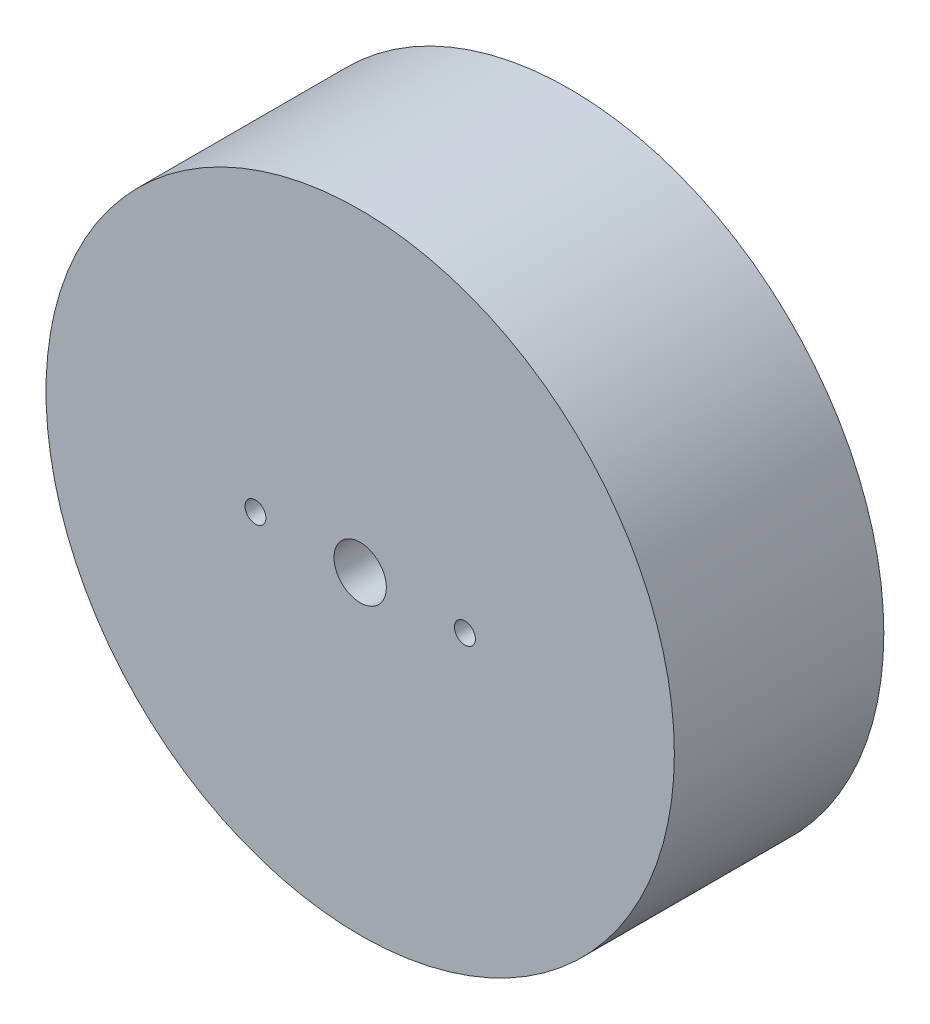
ISO-10303-21;
HEADER;
FILE_DESCRIPTION(('STEP AP214'),'2;1');
FILE_NAME('part.step','',(''),(''),'','','');
FILE_SCHEMA(('AUTOMOTIVE_DESIGN { 1 0 10303 214 1 1 1 1 }'));
ENDSEC;
DATA;
#1=APPLICATION_CONTEXT('core data for automotive mechanical design processes');
#2=APPLICATION_PROTOCOL_DEFINITION('international standard','automotive_design',2000,#1);
#3=PRODUCT_CONTEXT('',#1,'mechanical');
#4=PRODUCT('Part','Part','',(#3));
#5=PRODUCT_RELATED_PRODUCT_CATEGORY('part','',(#4));
#6=PRODUCT_DEFINITION_FORMATION('','',#4);
#7=PRODUCT_DEFINITION_CONTEXT('part definition',#1,'design');
#8=PRODUCT_DEFINITION('design','',#6,#7);
#9=PRODUCT_DEFINITION_SHAPE('','',#8);
#10=(LENGTH_UNIT() NAMED_UNIT(*) SI_UNIT(.MILLI.,.METRE.));
#11=(NAMED_UNIT(*) PLANE_ANGLE_UNIT() SI_UNIT($,.RADIAN.));
#12=(NAMED_UNIT(*) SI_UNIT($,.STERADIAN.) SOLID_ANGLE_UNIT());
#13=UNCERTAINTY_MEASURE_WITH_UNIT(LENGTH_MEASURE(1.E-05),#10,'distance_accuracy_value','');
#14=(GEOMETRIC_REPRESENTATION_CONTEXT(3) GLOBAL_UNCERTAINTY_ASSIGNED_CONTEXT((#13)) GLOBAL_UNIT_ASSIGNED_CONTEXT((#10,
#11,#12)) REPRESENTATION_CONTEXT('',''));
#15=CARTESIAN_POINT('',(0.,0.,0.));
#16=DIRECTION('',(0.,0.,1.));
#17=DIRECTION('',(1.,0.,0.));
#18=AXIS2_PLACEMENT_3D('',#15,#16,#17);
#19=CARTESIAN_POINT('',(0.,0.,20.));
#20=DIRECTION('',(0.,0.,1.));
#21=DIRECTION('',(1.,0.,0.));
#22=AXIS2_PLACEMENT_3D('',#19,#20,#21);
#23=PLANE('',#22);
#24=CARTESIAN_POINT('',(0.,0.,20.));
#25=DIRECTION('',(0.,0.,1.));
#26=DIRECTION('',(1.,0.,0.));
#27=AXIS2_PLACEMENT_3D('',#24,#25,#26);
#28=CIRCLE('',#27,2.49999999999995);
#29=CARTESIAN_POINT('',(2.49999999999995,0.,20.));
#30=VERTEX_POINT('',#29);
#31=EDGE_CURVE('E56',#30,#30,#28,.T.);
#32=ORIENTED_EDGE('',*,*,#31,.F.);
#33=EDGE_LOOP('',(#32));
#34=FACE_BOUND('',#33,.T.);
#35=CARTESIAN_POINT('',(10.,0.,20.));
#36=DIRECTION('',(0.,0.,1.));
#37=DIRECTION('',(1.,0.,0.));
#38=AXIS2_PLACEMENT_3D('',#35,#36,#37);
#39=CIRCLE('',#38,1.);
#40=CARTESIAN_POINT('',(11.,0.,20.));
#41=VERTEX_POINT('',#40);
#42=EDGE_CURVE('E42',#41,#41,#39,.T.);
#43=ORIENTED_EDGE('',*,*,#42,.F.);
#44=EDGE_LOOP('',(#43));
#45=FACE_BOUND('',#44,.T.);
#46=CARTESIAN_POINT('',(0.,0.,20.));
#47=DIRECTION('',(0.,0.,1.));
#48=DIRECTION('',(1.,0.,0.));
#49=AXIS2_PLACEMENT_3D('',#46,#47,#48);
#50=CIRCLE('',#49,30.);
#51=CARTESIAN_POINT('',(30.,0.,20.));
#52=VERTEX_POINT('',#51);
#53=EDGE_CURVE('E10',#52,#52,#50,.T.);
#54=ORIENTED_EDGE('',*,*,#53,.T.);
#55=EDGE_LOOP('',(#54));
#56=FACE_BOUND('',#55,.T.);
#57=CARTESIAN_POINT('',(-10.,0.,20.));
#58=DIRECTION('',(0.,0.,1.));
#59=DIRECTION('',(1.,0.,0.));
#60=AXIS2_PLACEMENT_3D('',#57,#58,#59);
#61=CIRCLE('',#60,1.);
#62=CARTESIAN_POINT('',(-9.,0.,20.));
#63=VERTEX_POINT('',#62);
#64=EDGE_CURVE('E47',#63,#63,#61,.T.);
#65=ORIENTED_EDGE('',*,*,#64,.F.);
#66=EDGE_LOOP('',(#65));
#67=FACE_BOUND('',#66,.T.);
#68=ADVANCED_FACE('F31',(#34,#45,#56,#67),#23,.T.);
#69=CARTESIAN_POINT('',(0.,0.,0.));
#70=DIRECTION('',(0.,0.,1.));
#71=DIRECTION('',(1.,0.,0.));
#72=AXIS2_PLACEMENT_3D('',#69,#70,#71);
#73=PLANE('',#72);
#74=CARTESIAN_POINT('',(0.,0.,0.));
#75=DIRECTION('',(0.,0.,1.));
#76=DIRECTION('',(1.,0.,0.));
#77=AXIS2_PLACEMENT_3D('',#74,#75,#76);
#78=CIRCLE('',#77,2.49999999999995);
#79=CARTESIAN_POINT('',(2.49999999999995,0.,0.));
#80=VERTEX_POINT('',#79);
#81=EDGE_CURVE('E53',#80,#80,#78,.T.);
#82=ORIENTED_EDGE('',*,*,#81,.T.);
#83=EDGE_LOOP('',(#82));
#84=FACE_BOUND('',#83,.T.);
#85=CARTESIAN_POINT('',(0.,0.,0.));
#86=DIRECTION('',(0.,0.,1.));
#87=DIRECTION('',(1.,0.,0.));
#88=AXIS2_PLACEMENT_3D('',#85,#86,#87);
#89=CIRCLE('',#88,30.);
#90=CARTESIAN_POINT('',(30.,0.,0.));
#91=VERTEX_POINT('',#90);
#92=EDGE_CURVE('E35',#91,#91,#89,.T.);
#93=ORIENTED_EDGE('',*,*,#92,.F.);
#94=EDGE_LOOP('',(#93));
#95=FACE_BOUND('',#94,.T.);
#96=CARTESIAN_POINT('',(10.,0.,0.));
#97=DIRECTION('',(0.,0.,1.));
#98=DIRECTION('',(1.,0.,0.));
#99=AXIS2_PLACEMENT_3D('',#96,#97,#98);
#100=CIRCLE('',#99,1.);
#101=CARTESIAN_POINT('',(11.,0.,0.));
#102=VERTEX_POINT('',#101);
#103=EDGE_CURVE('E44',#102,#102,#100,.T.);
#104=ORIENTED_EDGE('',*,*,#103,.T.);
#105=EDGE_LOOP('',(#104));
#106=FACE_BOUND('',#105,.T.);
#107=CARTESIAN_POINT('',(-10.,0.,0.));
#108=DIRECTION('',(0.,0.,1.));
#109=DIRECTION('',(1.,0.,0.));
#110=AXIS2_PLACEMENT_3D('',#107,#108,#109);
#111=CIRCLE('',#110,1.);
#112=CARTESIAN_POINT('',(-9.,0.,0.));
#113=VERTEX_POINT('',#112);
#114=EDGE_CURVE('E50',#113,#113,#111,.T.);
#115=ORIENTED_EDGE('',*,*,#114,.T.);
#116=EDGE_LOOP('',(#115));
#117=FACE_BOUND('',#116,.T.);
#118=ADVANCED_FACE('F62',(#84,#95,#106,#117),#73,.F.);
#119=CARTESIAN_POINT('',(0.,0.,20.));
#120=DIRECTION('',(0.,0.,-1.));
#121=DIRECTION('',(-1.,0.,0.));
#122=AXIS2_PLACEMENT_3D('',#119,#120,#121);
#123=CYLINDRICAL_SURFACE('',#122,30.);
#124=ORIENTED_EDGE('',*,*,#53,.F.);
#125=EDGE_LOOP('',(#124));
#126=FACE_BOUND('',#125,.T.);
#127=ORIENTED_EDGE('',*,*,#92,.T.);
#128=EDGE_LOOP('',(#127));
#129=FACE_BOUND('',#128,.T.);
#130=ADVANCED_FACE('F33',(#126,#129),#123,.T.);
#131=CARTESIAN_POINT('',(10.,0.,20.));
#132=DIRECTION('',(0.,0.,-1.));
#133=DIRECTION('',(-1.,0.,0.));
#134=AXIS2_PLACEMENT_3D('',#131,#132,#133);
#135=CYLINDRICAL_SURFACE('',#134,1.);
#136=ORIENTED_EDGE('',*,*,#42,.T.);
#137=EDGE_LOOP('',(#136));
#138=FACE_BOUND('',#137,.T.);
#139=ORIENTED_EDGE('',*,*,#103,.F.);
#140=EDGE_LOOP('',(#139));
#141=FACE_BOUND('',#140,.T.);
#142=ADVANCED_FACE('F81',(#138,#141),#135,.F.);
#143=CARTESIAN_POINT('',(-10.,0.,20.));
#144=DIRECTION('',(0.,0.,-1.));
#145=DIRECTION('',(-1.,0.,0.));
#146=AXIS2_PLACEMENT_3D('',#143,#144,#145);
#147=CYLINDRICAL_SURFACE('',#146,1.);
#148=ORIENTED_EDGE('',*,*,#64,.T.);
#149=EDGE_LOOP('',(#148));
#150=FACE_BOUND('',#149,.T.);
#151=ORIENTED_EDGE('',*,*,#114,.F.);
#152=EDGE_LOOP('',(#151));
#153=FACE_BOUND('',#152,.T.);
#154=ADVANCED_FACE('F68',(#150,#153),#147,.F.);
#155=CARTESIAN_POINT('',(0.,0.,0.));
#156=DIRECTION('',(0.,0.,1.));
#157=DIRECTION('',(1.,0.,0.));
#158=AXIS2_PLACEMENT_3D('',#155,#156,#157);
#159=CYLINDRICAL_SURFACE('',#158,2.49999999999995);
#160=ORIENTED_EDGE('',*,*,#81,.F.);
#161=EDGE_LOOP('',(#160));
#162=FACE_BOUND('',#161,.T.);
#163=ORIENTED_EDGE('',*,*,#31,.T.);
#164=EDGE_LOOP('',(#163));
#165=FACE_BOUND('',#164,.T.);
#166=ADVANCED_FACE('F65',(#162,#165),#159,.F.);
#167=CLOSED_SHELL('',(#68,#118,#130,#142,#154,#166));
#168=MANIFOLD_SOLID_BREP('B2',#167);
#169=ADVANCED_BREP_SHAPE_REPRESENTATION('',(#18,#168),#14);
#170=SHAPE_DEFINITION_REPRESENTATION(#9,#169);
ENDSEC;
END-ISO-10303-21;
